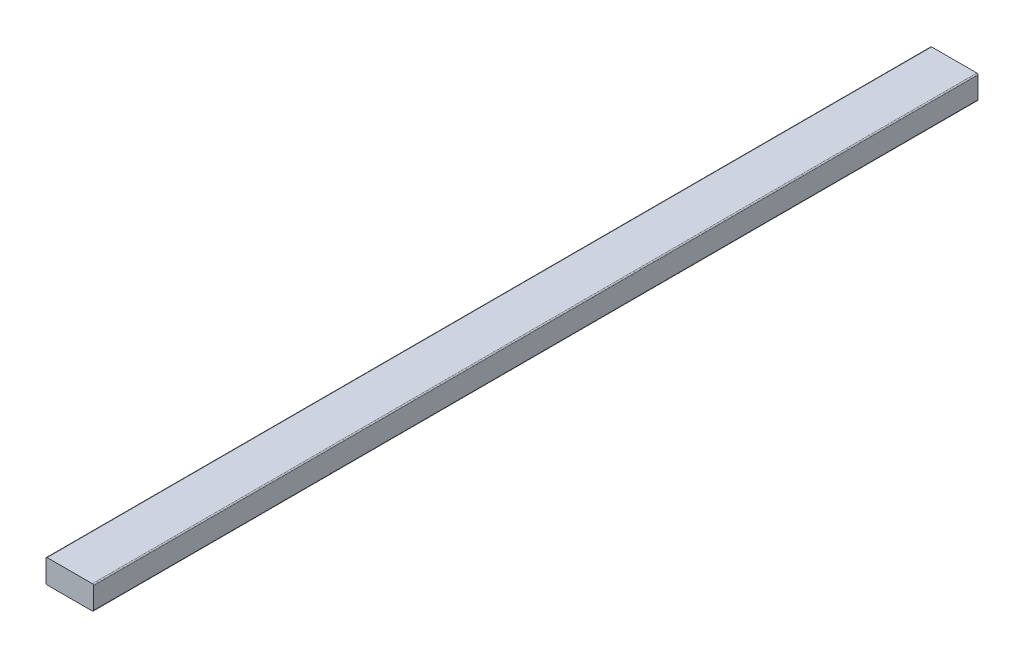
ISO-10303-21;
HEADER;
FILE_DESCRIPTION(('STEP AP214'),'2;1');
FILE_NAME('part.step','',(''),(''),'','','');
FILE_SCHEMA(('AUTOMOTIVE_DESIGN { 1 0 10303 214 1 1 1 1 }'));
ENDSEC;
DATA;
#1=APPLICATION_CONTEXT('core data for automotive mechanical design processes');
#2=APPLICATION_PROTOCOL_DEFINITION('international standard','automotive_design',2000,#1);
#3=PRODUCT_CONTEXT('',#1,'mechanical');
#4=PRODUCT('Part','Part','',(#3));
#5=PRODUCT_RELATED_PRODUCT_CATEGORY('part','',(#4));
#6=PRODUCT_DEFINITION_FORMATION('','',#4);
#7=PRODUCT_DEFINITION_CONTEXT('part definition',#1,'design');
#8=PRODUCT_DEFINITION('design','',#6,#7);
#9=PRODUCT_DEFINITION_SHAPE('','',#8);
#10=(LENGTH_UNIT() NAMED_UNIT(*) SI_UNIT(.MILLI.,.METRE.));
#11=(NAMED_UNIT(*) PLANE_ANGLE_UNIT() SI_UNIT($,.RADIAN.));
#12=(NAMED_UNIT(*) SI_UNIT($,.STERADIAN.) SOLID_ANGLE_UNIT());
#13=UNCERTAINTY_MEASURE_WITH_UNIT(LENGTH_MEASURE(1.E-05),#10,'distance_accuracy_value','');
#14=(GEOMETRIC_REPRESENTATION_CONTEXT(3) GLOBAL_UNCERTAINTY_ASSIGNED_CONTEXT((#13)) GLOBAL_UNIT_ASSIGNED_CONTEXT((#10,
#11,#12)) REPRESENTATION_CONTEXT('',''));
#15=CARTESIAN_POINT('',(0.,0.,0.));
#16=DIRECTION('',(0.,0.,1.));
#17=DIRECTION('',(1.,0.,0.));
#18=AXIS2_PLACEMENT_3D('',#15,#16,#17);
#19=CARTESIAN_POINT('',(20.,-10.,745.));
#20=DIRECTION('',(-1.,0.,0.));
#21=DIRECTION('',(0.,0.,1.));
#22=AXIS2_PLACEMENT_3D('',#19,#20,#21);
#23=PLANE('',#22);
#24=DIRECTION('',(0.,1.,0.));
#25=VECTOR('',#24,1.);
#26=CARTESIAN_POINT('',(20.,-10.,745.));
#27=LINE('',#26,#25);
#28=CARTESIAN_POINT('',(20.,-9.,745.));
#29=VERTEX_POINT('',#28);
#30=CARTESIAN_POINT('',(20.,9.,745.));
#31=VERTEX_POINT('',#30);
#32=EDGE_CURVE('E118',#29,#31,#27,.T.);
#33=ORIENTED_EDGE('',*,*,#32,.F.);
#34=DIRECTION('',(0.,0.,-1.));
#35=VECTOR('',#34,1.);
#36=CARTESIAN_POINT('',(20.,-9.,745.));
#37=LINE('',#36,#35);
#38=CARTESIAN_POINT('',(20.,-9.,0.));
#39=VERTEX_POINT('',#38);
#40=EDGE_CURVE('E103',#29,#39,#37,.T.);
#41=ORIENTED_EDGE('',*,*,#40,.T.);
#42=DIRECTION('',(0.,1.,0.));
#43=VECTOR('',#42,1.);
#44=CARTESIAN_POINT('',(20.,-10.,0.));
#45=LINE('',#44,#43);
#46=CARTESIAN_POINT('',(20.,9.,0.));
#47=VERTEX_POINT('',#46);
#48=EDGE_CURVE('E115',#39,#47,#45,.T.);
#49=ORIENTED_EDGE('',*,*,#48,.T.);
#50=DIRECTION('',(0.,0.,-1.));
#51=VECTOR('',#50,1.);
#52=CARTESIAN_POINT('',(20.,9.,745.));
#53=LINE('',#52,#51);
#54=EDGE_CURVE('E120',#47,#31,#53,.F.);
#55=ORIENTED_EDGE('',*,*,#54,.T.);
#56=EDGE_LOOP('',(#33,#41,#49,#55));
#57=FACE_BOUND('',#56,.T.);
#58=ADVANCED_FACE('F33',(#57),#23,.F.);
#59=CARTESIAN_POINT('',(-20.,10.,745.));
#60=DIRECTION('',(0.,-1.,0.));
#61=DIRECTION('',(0.,0.,-1.));
#62=AXIS2_PLACEMENT_3D('',#59,#60,#61);
#63=PLANE('',#62);
#64=DIRECTION('',(-1.,0.,0.));
#65=VECTOR('',#64,1.);
#66=CARTESIAN_POINT('',(-20.,10.,0.));
#67=LINE('',#66,#65);
#68=CARTESIAN_POINT('',(19.,10.,0.));
#69=VERTEX_POINT('',#68);
#70=CARTESIAN_POINT('',(-19.,10.,0.));
#71=VERTEX_POINT('',#70);
#72=EDGE_CURVE('E124',#69,#71,#67,.T.);
#73=ORIENTED_EDGE('',*,*,#72,.T.);
#74=DIRECTION('',(0.,0.,-1.));
#75=VECTOR('',#74,1.);
#76=CARTESIAN_POINT('',(-19.,10.,745.));
#77=LINE('',#76,#75);
#78=CARTESIAN_POINT('',(-19.,10.,745.));
#79=VERTEX_POINT('',#78);
#80=EDGE_CURVE('E11',#71,#79,#77,.F.);
#81=ORIENTED_EDGE('',*,*,#80,.T.);
#82=DIRECTION('',(-1.,0.,0.));
#83=VECTOR('',#82,1.);
#84=CARTESIAN_POINT('',(-20.,10.,745.));
#85=LINE('',#84,#83);
#86=CARTESIAN_POINT('',(19.,10.,745.));
#87=VERTEX_POINT('',#86);
#88=EDGE_CURVE('E160',#87,#79,#85,.T.);
#89=ORIENTED_EDGE('',*,*,#88,.F.);
#90=DIRECTION('',(0.,0.,-1.));
#91=VECTOR('',#90,1.);
#92=CARTESIAN_POINT('',(19.,10.,745.));
#93=LINE('',#92,#91);
#94=EDGE_CURVE('E41',#87,#69,#93,.T.);
#95=ORIENTED_EDGE('',*,*,#94,.T.);
#96=EDGE_LOOP('',(#73,#81,#89,#95));
#97=FACE_BOUND('',#96,.T.);
#98=ADVANCED_FACE('F158',(#97),#63,.F.);
#99=CARTESIAN_POINT('',(-20.,-10.,745.));
#100=DIRECTION('',(1.,0.,0.));
#101=DIRECTION('',(0.,0.,-1.));
#102=AXIS2_PLACEMENT_3D('',#99,#100,#101);
#103=PLANE('',#102);
#104=DIRECTION('',(0.,-1.,0.));
#105=VECTOR('',#104,1.);
#106=CARTESIAN_POINT('',(-20.,-10.,0.));
#107=LINE('',#106,#105);
#108=CARTESIAN_POINT('',(-20.,9.,0.));
#109=VERTEX_POINT('',#108);
#110=CARTESIAN_POINT('',(-20.,-9.,0.));
#111=VERTEX_POINT('',#110);
#112=EDGE_CURVE('E127',#109,#111,#107,.T.);
#113=ORIENTED_EDGE('',*,*,#112,.T.);
#114=DIRECTION('',(0.,0.,-1.));
#115=VECTOR('',#114,1.);
#116=CARTESIAN_POINT('',(-20.,-9.,745.));
#117=LINE('',#116,#115);
#118=CARTESIAN_POINT('',(-20.,-9.,745.));
#119=VERTEX_POINT('',#118);
#120=EDGE_CURVE('E48',#111,#119,#117,.F.);
#121=ORIENTED_EDGE('',*,*,#120,.T.);
#122=DIRECTION('',(0.,-1.,0.));
#123=VECTOR('',#122,1.);
#124=CARTESIAN_POINT('',(-20.,-10.,745.));
#125=LINE('',#124,#123);
#126=CARTESIAN_POINT('',(-20.,9.,745.));
#127=VERTEX_POINT('',#126);
#128=EDGE_CURVE('E168',#127,#119,#125,.T.);
#129=ORIENTED_EDGE('',*,*,#128,.F.);
#130=DIRECTION('',(0.,0.,-1.));
#131=VECTOR('',#130,1.);
#132=CARTESIAN_POINT('',(-20.,9.,745.));
#133=LINE('',#132,#131);
#134=EDGE_CURVE('E151',#127,#109,#133,.T.);
#135=ORIENTED_EDGE('',*,*,#134,.T.);
#136=EDGE_LOOP('',(#113,#121,#129,#135));
#137=FACE_BOUND('',#136,.T.);
#138=ADVANCED_FACE('F167',(#137),#103,.F.);
#139=CARTESIAN_POINT('',(-20.,-10.,745.));
#140=DIRECTION('',(0.,1.,0.));
#141=DIRECTION('',(0.,0.,1.));
#142=AXIS2_PLACEMENT_3D('',#139,#140,#141);
#143=PLANE('',#142);
#144=DIRECTION('',(1.,0.,0.));
#145=VECTOR('',#144,1.);
#146=CARTESIAN_POINT('',(-20.,-10.,0.));
#147=LINE('',#146,#145);
#148=CARTESIAN_POINT('',(-19.,-10.,0.));
#149=VERTEX_POINT('',#148);
#150=CARTESIAN_POINT('',(19.,-10.,0.));
#151=VERTEX_POINT('',#150);
#152=EDGE_CURVE('E134',#149,#151,#147,.T.);
#153=ORIENTED_EDGE('',*,*,#152,.T.);
#154=DIRECTION('',(0.,0.,-1.));
#155=VECTOR('',#154,1.);
#156=CARTESIAN_POINT('',(19.,-10.,745.));
#157=LINE('',#156,#155);
#158=CARTESIAN_POINT('',(19.,-10.,745.));
#159=VERTEX_POINT('',#158);
#160=EDGE_CURVE('E104',#151,#159,#157,.F.);
#161=ORIENTED_EDGE('',*,*,#160,.T.);
#162=DIRECTION('',(1.,0.,0.));
#163=VECTOR('',#162,1.);
#164=CARTESIAN_POINT('',(-20.,-10.,745.));
#165=LINE('',#164,#163);
#166=CARTESIAN_POINT('',(-19.,-10.,745.));
#167=VERTEX_POINT('',#166);
#168=EDGE_CURVE('E130',#167,#159,#165,.T.);
#169=ORIENTED_EDGE('',*,*,#168,.F.);
#170=DIRECTION('',(0.,0.,-1.));
#171=VECTOR('',#170,1.);
#172=CARTESIAN_POINT('',(-19.,-10.,745.));
#173=LINE('',#172,#171);
#174=EDGE_CURVE('E109',#167,#149,#173,.T.);
#175=ORIENTED_EDGE('',*,*,#174,.T.);
#176=EDGE_LOOP('',(#153,#161,#169,#175));
#177=FACE_BOUND('',#176,.T.);
#178=ADVANCED_FACE('F196',(#177),#143,.F.);
#179=CARTESIAN_POINT('',(0.,0.,745.));
#180=DIRECTION('',(0.,0.,-1.));
#181=DIRECTION('',(-1.,0.,0.));
#182=AXIS2_PLACEMENT_3D('',#179,#180,#181);
#183=PLANE('',#182);
#184=ORIENTED_EDGE('',*,*,#168,.T.);
#185=CARTESIAN_POINT('',(19.,-9.,745.));
#186=DIRECTION('',(0.,0.,-1.));
#187=DIRECTION('',(-1.,0.,0.));
#188=AXIS2_PLACEMENT_3D('',#185,#186,#187);
#189=CIRCLE('',#188,1.);
#190=EDGE_CURVE('E149',#159,#29,#189,.F.);
#191=ORIENTED_EDGE('',*,*,#190,.T.);
#192=ORIENTED_EDGE('',*,*,#32,.T.);
#193=CARTESIAN_POINT('',(19.,9.,745.));
#194=DIRECTION('',(0.,0.,-1.));
#195=DIRECTION('',(-1.,0.,0.));
#196=AXIS2_PLACEMENT_3D('',#193,#194,#195);
#197=CIRCLE('',#196,1.);
#198=EDGE_CURVE('E144',#31,#87,#197,.F.);
#199=ORIENTED_EDGE('',*,*,#198,.T.);
#200=ORIENTED_EDGE('',*,*,#88,.T.);
#201=CARTESIAN_POINT('',(-19.,9.,745.));
#202=DIRECTION('',(0.,0.,-1.));
#203=DIRECTION('',(-1.,0.,0.));
#204=AXIS2_PLACEMENT_3D('',#201,#202,#203);
#205=CIRCLE('',#204,1.);
#206=EDGE_CURVE('E55',#79,#127,#205,.F.);
#207=ORIENTED_EDGE('',*,*,#206,.T.);
#208=ORIENTED_EDGE('',*,*,#128,.T.);
#209=CARTESIAN_POINT('',(-19.,-9.,745.));
#210=DIRECTION('',(0.,0.,-1.));
#211=DIRECTION('',(-1.,0.,0.));
#212=AXIS2_PLACEMENT_3D('',#209,#210,#211);
#213=CIRCLE('',#212,1.);
#214=EDGE_CURVE('E147',#119,#167,#213,.F.);
#215=ORIENTED_EDGE('',*,*,#214,.T.);
#216=EDGE_LOOP('',(#184,#191,#192,#199,#200,#207,#208,#215));
#217=FACE_BOUND('',#216,.T.);
#218=ADVANCED_FACE('F173',(#217),#183,.F.);
#219=CARTESIAN_POINT('',(0.,0.,0.));
#220=DIRECTION('',(0.,0.,-1.));
#221=DIRECTION('',(-1.,0.,0.));
#222=AXIS2_PLACEMENT_3D('',#219,#220,#221);
#223=PLANE('',#222);
#224=ORIENTED_EDGE('',*,*,#48,.F.);
#225=CARTESIAN_POINT('',(19.,-9.,0.));
#226=DIRECTION('',(0.,0.,-1.));
#227=DIRECTION('',(-1.,0.,0.));
#228=AXIS2_PLACEMENT_3D('',#225,#226,#227);
#229=CIRCLE('',#228,1.);
#230=EDGE_CURVE('E99',#39,#151,#229,.T.);
#231=ORIENTED_EDGE('',*,*,#230,.T.);
#232=ORIENTED_EDGE('',*,*,#152,.F.);
#233=CARTESIAN_POINT('',(-19.,-9.,0.));
#234=DIRECTION('',(0.,0.,-1.));
#235=DIRECTION('',(-1.,0.,0.));
#236=AXIS2_PLACEMENT_3D('',#233,#234,#235);
#237=CIRCLE('',#236,1.);
#238=EDGE_CURVE('E110',#149,#111,#237,.T.);
#239=ORIENTED_EDGE('',*,*,#238,.T.);
#240=ORIENTED_EDGE('',*,*,#112,.F.);
#241=CARTESIAN_POINT('',(-19.,9.,0.));
#242=DIRECTION('',(0.,0.,-1.));
#243=DIRECTION('',(-1.,0.,0.));
#244=AXIS2_PLACEMENT_3D('',#241,#242,#243);
#245=CIRCLE('',#244,1.);
#246=EDGE_CURVE('E138',#109,#71,#245,.T.);
#247=ORIENTED_EDGE('',*,*,#246,.T.);
#248=ORIENTED_EDGE('',*,*,#72,.F.);
#249=CARTESIAN_POINT('',(19.,9.,0.));
#250=DIRECTION('',(0.,0.,-1.));
#251=DIRECTION('',(-1.,0.,0.));
#252=AXIS2_PLACEMENT_3D('',#249,#250,#251);
#253=CIRCLE('',#252,1.);
#254=EDGE_CURVE('E119',#69,#47,#253,.T.);
#255=ORIENTED_EDGE('',*,*,#254,.T.);
#256=EDGE_LOOP('',(#224,#231,#232,#239,#240,#247,#248,#255));
#257=FACE_BOUND('',#256,.T.);
#258=ADVANCED_FACE('F122',(#257),#223,.T.);
#259=CARTESIAN_POINT('',(19.,-9.,745.));
#260=DIRECTION('',(0.,0.,-1.));
#261=DIRECTION('',(-1.,0.,0.));
#262=AXIS2_PLACEMENT_3D('',#259,#260,#261);
#263=CYLINDRICAL_SURFACE('',#262,1.);
#264=ORIENTED_EDGE('',*,*,#190,.F.);
#265=ORIENTED_EDGE('',*,*,#160,.F.);
#266=ORIENTED_EDGE('',*,*,#230,.F.);
#267=ORIENTED_EDGE('',*,*,#40,.F.);
#268=EDGE_LOOP('',(#264,#265,#266,#267));
#269=FACE_BOUND('',#268,.T.);
#270=ADVANCED_FACE('F102',(#269),#263,.T.);
#271=CARTESIAN_POINT('',(-19.,-9.,745.));
#272=DIRECTION('',(0.,0.,-1.));
#273=DIRECTION('',(-1.,0.,0.));
#274=AXIS2_PLACEMENT_3D('',#271,#272,#273);
#275=CYLINDRICAL_SURFACE('',#274,1.);
#276=ORIENTED_EDGE('',*,*,#214,.F.);
#277=ORIENTED_EDGE('',*,*,#120,.F.);
#278=ORIENTED_EDGE('',*,*,#238,.F.);
#279=ORIENTED_EDGE('',*,*,#174,.F.);
#280=EDGE_LOOP('',(#276,#277,#278,#279));
#281=FACE_BOUND('',#280,.T.);
#282=ADVANCED_FACE('F178',(#281),#275,.T.);
#283=CARTESIAN_POINT('',(-19.,9.,745.));
#284=DIRECTION('',(0.,0.,-1.));
#285=DIRECTION('',(-1.,0.,0.));
#286=AXIS2_PLACEMENT_3D('',#283,#284,#285);
#287=CYLINDRICAL_SURFACE('',#286,1.);
#288=ORIENTED_EDGE('',*,*,#206,.F.);
#289=ORIENTED_EDGE('',*,*,#80,.F.);
#290=ORIENTED_EDGE('',*,*,#246,.F.);
#291=ORIENTED_EDGE('',*,*,#134,.F.);
#292=EDGE_LOOP('',(#288,#289,#290,#291));
#293=FACE_BOUND('',#292,.T.);
#294=ADVANCED_FACE('F166',(#293),#287,.T.);
#295=CARTESIAN_POINT('',(19.,9.,745.));
#296=DIRECTION('',(0.,0.,-1.));
#297=DIRECTION('',(-1.,0.,0.));
#298=AXIS2_PLACEMENT_3D('',#295,#296,#297);
#299=CYLINDRICAL_SURFACE('',#298,1.);
#300=ORIENTED_EDGE('',*,*,#198,.F.);
#301=ORIENTED_EDGE('',*,*,#54,.F.);
#302=ORIENTED_EDGE('',*,*,#254,.F.);
#303=ORIENTED_EDGE('',*,*,#94,.F.);
#304=EDGE_LOOP('',(#300,#301,#302,#303));
#305=FACE_BOUND('',#304,.T.);
#306=ADVANCED_FACE('F35',(#305),#299,.T.);
#307=CLOSED_SHELL('',(#58,#98,#138,#178,#218,#258,#270,#282,#294,#306));
#308=MANIFOLD_SOLID_BREP('B2',#307);
#309=ADVANCED_BREP_SHAPE_REPRESENTATION('',(#18,#308),#14);
#310=SHAPE_DEFINITION_REPRESENTATION(#9,#309);
ENDSEC;
END-ISO-10303-21;
